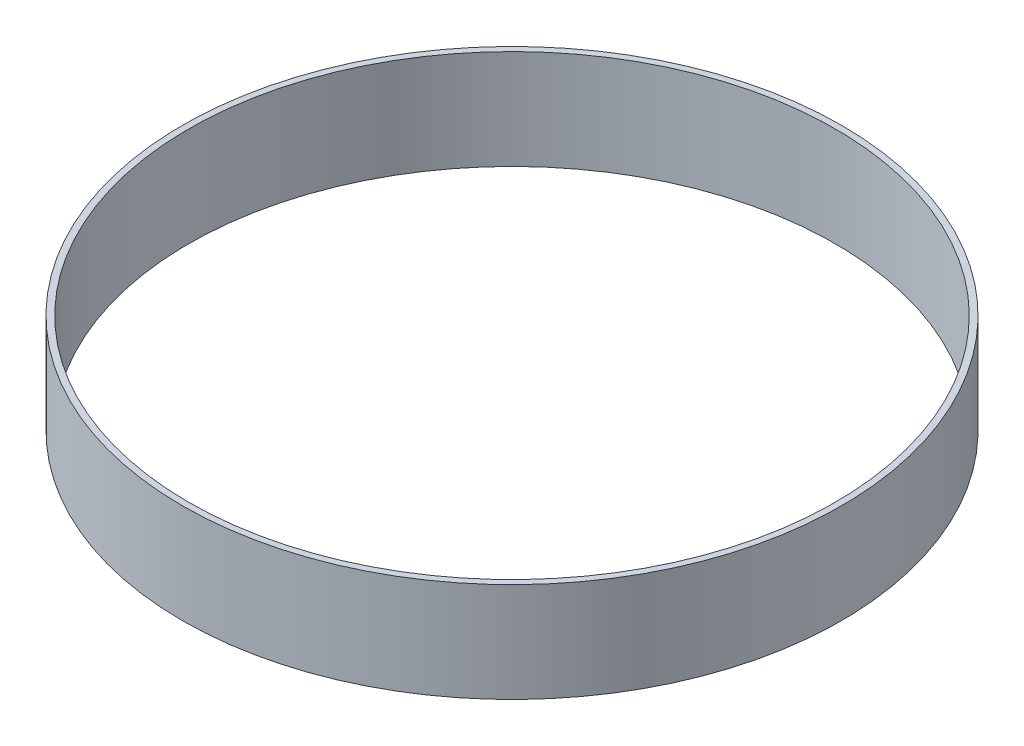
ISO-10303-21;
HEADER;
FILE_DESCRIPTION(('STEP AP214'),'2;1');
FILE_NAME('part.step','',(''),(''),'','','');
FILE_SCHEMA(('AUTOMOTIVE_DESIGN { 1 0 10303 214 1 1 1 1 }'));
ENDSEC;
DATA;
#1=APPLICATION_CONTEXT('core data for automotive mechanical design processes');
#2=APPLICATION_PROTOCOL_DEFINITION('international standard','automotive_design',2000,#1);
#3=PRODUCT_CONTEXT('',#1,'mechanical');
#4=PRODUCT('Part','Part','',(#3));
#5=PRODUCT_RELATED_PRODUCT_CATEGORY('part','',(#4));
#6=PRODUCT_DEFINITION_FORMATION('','',#4);
#7=PRODUCT_DEFINITION_CONTEXT('part definition',#1,'design');
#8=PRODUCT_DEFINITION('design','',#6,#7);
#9=PRODUCT_DEFINITION_SHAPE('','',#8);
#10=(LENGTH_UNIT() NAMED_UNIT(*) SI_UNIT(.MILLI.,.METRE.));
#11=(NAMED_UNIT(*) PLANE_ANGLE_UNIT() SI_UNIT($,.RADIAN.));
#12=(NAMED_UNIT(*) SI_UNIT($,.STERADIAN.) SOLID_ANGLE_UNIT());
#13=UNCERTAINTY_MEASURE_WITH_UNIT(LENGTH_MEASURE(1.E-05),#10,'distance_accuracy_value','');
#14=(GEOMETRIC_REPRESENTATION_CONTEXT(3) GLOBAL_UNCERTAINTY_ASSIGNED_CONTEXT((#13)) GLOBAL_UNIT_ASSIGNED_CONTEXT((#10,
#11,#12)) REPRESENTATION_CONTEXT('',''));
#15=CARTESIAN_POINT('',(0.,0.,0.));
#16=DIRECTION('',(0.,0.,1.));
#17=DIRECTION('',(1.,0.,0.));
#18=AXIS2_PLACEMENT_3D('',#15,#16,#17);
#19=CARTESIAN_POINT('',(0.,40.,0.));
#20=DIRECTION('',(0.,1.,0.));
#21=DIRECTION('',(0.,0.,1.));
#22=AXIS2_PLACEMENT_3D('',#19,#20,#21);
#23=PLANE('',#22);
#24=CARTESIAN_POINT('',(0.,40.,0.));
#25=DIRECTION('',(0.,1.,0.));
#26=DIRECTION('',(0.,0.,1.));
#27=AXIS2_PLACEMENT_3D('',#24,#25,#26);
#28=CIRCLE('',#27,132.5);
#29=CARTESIAN_POINT('',(0.,40.,132.5));
#30=VERTEX_POINT('',#29);
#31=EDGE_CURVE('E10',#30,#30,#28,.T.);
#32=ORIENTED_EDGE('',*,*,#31,.T.);
#33=EDGE_LOOP('',(#32));
#34=FACE_BOUND('',#33,.T.);
#35=CARTESIAN_POINT('',(0.,40.,0.));
#36=DIRECTION('',(0.,1.,0.));
#37=DIRECTION('',(0.,0.,1.));
#38=AXIS2_PLACEMENT_3D('',#35,#36,#37);
#39=CIRCLE('',#38,130.);
#40=CARTESIAN_POINT('',(0.,40.,130.));
#41=VERTEX_POINT('',#40);
#42=EDGE_CURVE('E42',#41,#41,#39,.T.);
#43=ORIENTED_EDGE('',*,*,#42,.F.);
#44=EDGE_LOOP('',(#43));
#45=FACE_BOUND('',#44,.T.);
#46=ADVANCED_FACE('F31',(#34,#45),#23,.T.);
#47=CARTESIAN_POINT('',(0.,0.,0.));
#48=DIRECTION('',(0.,1.,0.));
#49=DIRECTION('',(0.,0.,1.));
#50=AXIS2_PLACEMENT_3D('',#47,#48,#49);
#51=PLANE('',#50);
#52=CARTESIAN_POINT('',(0.,0.,0.));
#53=DIRECTION('',(0.,1.,0.));
#54=DIRECTION('',(0.,0.,1.));
#55=AXIS2_PLACEMENT_3D('',#52,#53,#54);
#56=CIRCLE('',#55,132.5);
#57=CARTESIAN_POINT('',(0.,0.,132.5));
#58=VERTEX_POINT('',#57);
#59=EDGE_CURVE('E35',#58,#58,#56,.T.);
#60=ORIENTED_EDGE('',*,*,#59,.F.);
#61=EDGE_LOOP('',(#60));
#62=FACE_BOUND('',#61,.T.);
#63=CARTESIAN_POINT('',(0.,0.,0.));
#64=DIRECTION('',(0.,1.,0.));
#65=DIRECTION('',(0.,0.,1.));
#66=AXIS2_PLACEMENT_3D('',#63,#64,#65);
#67=CIRCLE('',#66,130.);
#68=CARTESIAN_POINT('',(0.,0.,130.));
#69=VERTEX_POINT('',#68);
#70=EDGE_CURVE('E44',#69,#69,#67,.T.);
#71=ORIENTED_EDGE('',*,*,#70,.T.);
#72=EDGE_LOOP('',(#71));
#73=FACE_BOUND('',#72,.T.);
#74=ADVANCED_FACE('F54',(#62,#73),#51,.F.);
#75=CARTESIAN_POINT('',(0.,40.,0.));
#76=DIRECTION('',(0.,-1.,0.));
#77=DIRECTION('',(0.,0.,-1.));
#78=AXIS2_PLACEMENT_3D('',#75,#76,#77);
#79=CYLINDRICAL_SURFACE('',#78,132.5);
#80=ORIENTED_EDGE('',*,*,#31,.F.);
#81=EDGE_LOOP('',(#80));
#82=FACE_BOUND('',#81,.T.);
#83=ORIENTED_EDGE('',*,*,#59,.T.);
#84=EDGE_LOOP('',(#83));
#85=FACE_BOUND('',#84,.T.);
#86=ADVANCED_FACE('F33',(#82,#85),#79,.T.);
#87=CARTESIAN_POINT('',(0.,40.,0.));
#88=DIRECTION('',(0.,-1.,0.));
#89=DIRECTION('',(0.,0.,-1.));
#90=AXIS2_PLACEMENT_3D('',#87,#88,#89);
#91=CYLINDRICAL_SURFACE('',#90,130.);
#92=ORIENTED_EDGE('',*,*,#42,.T.);
#93=EDGE_LOOP('',(#92));
#94=FACE_BOUND('',#93,.T.);
#95=ORIENTED_EDGE('',*,*,#70,.F.);
#96=EDGE_LOOP('',(#95));
#97=FACE_BOUND('',#96,.T.);
#98=ADVANCED_FACE('F50',(#94,#97),#91,.F.);
#99=CLOSED_SHELL('',(#46,#74,#86,#98));
#100=MANIFOLD_SOLID_BREP('B2',#99);
#101=ADVANCED_BREP_SHAPE_REPRESENTATION('',(#18,#100),#14);
#102=SHAPE_DEFINITION_REPRESENTATION(#9,#101);
ENDSEC;
END-ISO-10303-21;
